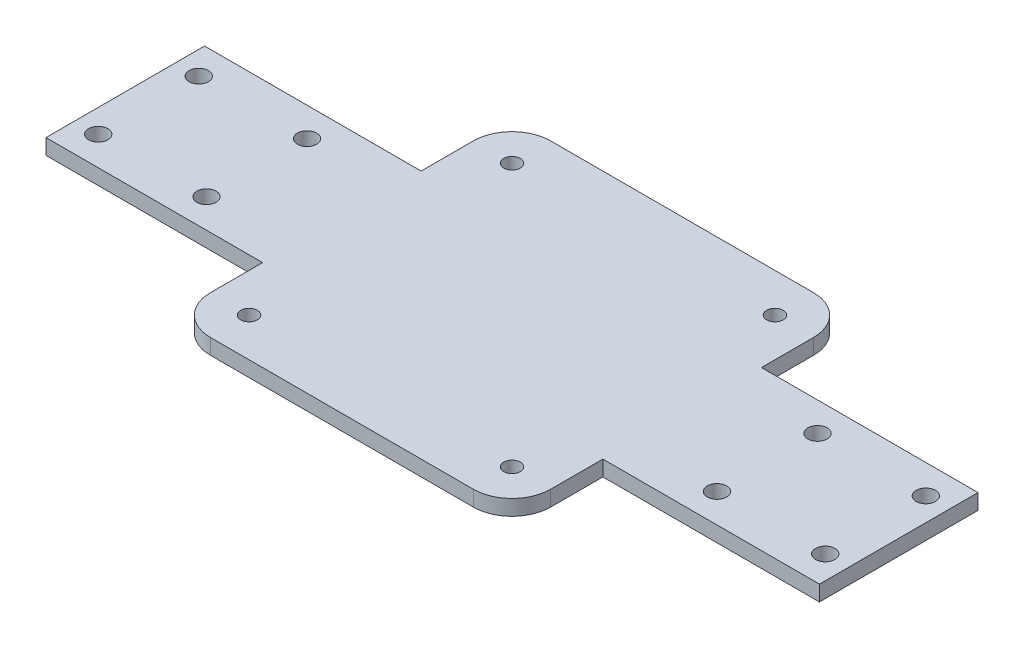
ISO-10303-21;
HEADER;
FILE_DESCRIPTION(('STEP AP214'),'2;1');
FILE_NAME('part.step','',(''),(''),'','','');
FILE_SCHEMA(('AUTOMOTIVE_DESIGN { 1 0 10303 214 1 1 1 1 }'));
ENDSEC;
DATA;
#1=APPLICATION_CONTEXT('core data for automotive mechanical design processes');
#2=APPLICATION_PROTOCOL_DEFINITION('international standard','automotive_design',2000,#1);
#3=PRODUCT_CONTEXT('',#1,'mechanical');
#4=PRODUCT('Part','Part','',(#3));
#5=PRODUCT_RELATED_PRODUCT_CATEGORY('part','',(#4));
#6=PRODUCT_DEFINITION_FORMATION('','',#4);
#7=PRODUCT_DEFINITION_CONTEXT('part definition',#1,'design');
#8=PRODUCT_DEFINITION('design','',#6,#7);
#9=PRODUCT_DEFINITION_SHAPE('','',#8);
#10=(LENGTH_UNIT() NAMED_UNIT(*) SI_UNIT(.MILLI.,.METRE.));
#11=(NAMED_UNIT(*) PLANE_ANGLE_UNIT() SI_UNIT($,.RADIAN.));
#12=(NAMED_UNIT(*) SI_UNIT($,.STERADIAN.) SOLID_ANGLE_UNIT());
#13=UNCERTAINTY_MEASURE_WITH_UNIT(LENGTH_MEASURE(1.E-05),#10,'distance_accuracy_value','');
#14=(GEOMETRIC_REPRESENTATION_CONTEXT(3) GLOBAL_UNCERTAINTY_ASSIGNED_CONTEXT((#13)) GLOBAL_UNIT_ASSIGNED_CONTEXT((#10,
#11,#12)) REPRESENTATION_CONTEXT('',''));
#15=CARTESIAN_POINT('',(0.,0.,0.));
#16=DIRECTION('',(0.,0.,1.));
#17=DIRECTION('',(1.,0.,0.));
#18=AXIS2_PLACEMENT_3D('',#15,#16,#17);
#19=CARTESIAN_POINT('',(-44.,4.,44.));
#20=DIRECTION('',(1.,0.,0.));
#21=DIRECTION('',(0.,0.,-1.));
#22=AXIS2_PLACEMENT_3D('',#19,#20,#21);
#23=PLANE('',#22);
#24=DIRECTION('',(0.,1.,0.));
#25=VECTOR('',#24,1.);
#26=CARTESIAN_POINT('',(-44.,4.,20.5));
#27=LINE('',#26,#25);
#28=CARTESIAN_POINT('',(-44.,0.,20.5));
#29=VERTEX_POINT('',#28);
#30=CARTESIAN_POINT('',(-44.,4.,20.5));
#31=VERTEX_POINT('',#30);
#32=EDGE_CURVE('E197',#29,#31,#27,.T.);
#33=ORIENTED_EDGE('',*,*,#32,.F.);
#34=DIRECTION('',(0.,0.,1.));
#35=VECTOR('',#34,1.);
#36=CARTESIAN_POINT('',(-44.,0.,44.));
#37=LINE('',#36,#35);
#38=CARTESIAN_POINT('',(-44.,0.,34.));
#39=VERTEX_POINT('',#38);
#40=EDGE_CURVE('E221',#29,#39,#37,.T.);
#41=ORIENTED_EDGE('',*,*,#40,.T.);
#42=DIRECTION('',(0.,-1.,0.));
#43=VECTOR('',#42,1.);
#44=CARTESIAN_POINT('',(-44.,4.,34.));
#45=LINE('',#44,#43);
#46=CARTESIAN_POINT('',(-44.,4.,34.));
#47=VERTEX_POINT('',#46);
#48=EDGE_CURVE('E267',#39,#47,#45,.F.);
#49=ORIENTED_EDGE('',*,*,#48,.T.);
#50=DIRECTION('',(0.,0.,1.));
#51=VECTOR('',#50,1.);
#52=CARTESIAN_POINT('',(-44.,4.,44.));
#53=LINE('',#52,#51);
#54=EDGE_CURVE('E227',#31,#47,#53,.T.);
#55=ORIENTED_EDGE('',*,*,#54,.F.);
#56=EDGE_LOOP('',(#33,#41,#49,#55));
#57=FACE_BOUND('',#56,.T.);
#58=ADVANCED_FACE('F39',(#57),#23,.F.);
#59=DIRECTION('',(0.,-1.,0.));
#60=VECTOR('',#59,1.);
#61=CARTESIAN_POINT('',(-44.,4.,-20.5));
#62=LINE('',#61,#60);
#63=CARTESIAN_POINT('',(-44.,4.,-20.5));
#64=VERTEX_POINT('',#63);
#65=CARTESIAN_POINT('',(-44.,0.,-20.5));
#66=VERTEX_POINT('',#65);
#67=EDGE_CURVE('E176',#64,#66,#62,.T.);
#68=ORIENTED_EDGE('',*,*,#67,.F.);
#69=CARTESIAN_POINT('',(-44.,4.,-34.));
#70=VERTEX_POINT('',#69);
#71=EDGE_CURVE('E224',#70,#64,#53,.T.);
#72=ORIENTED_EDGE('',*,*,#71,.F.);
#73=DIRECTION('',(0.,-1.,0.));
#74=VECTOR('',#73,1.);
#75=CARTESIAN_POINT('',(-44.,4.,-34.));
#76=LINE('',#75,#74);
#77=CARTESIAN_POINT('',(-44.,0.,-34.));
#78=VERTEX_POINT('',#77);
#79=EDGE_CURVE('E264',#70,#78,#76,.T.);
#80=ORIENTED_EDGE('',*,*,#79,.T.);
#81=EDGE_CURVE('E237',#78,#66,#37,.T.);
#82=ORIENTED_EDGE('',*,*,#81,.T.);
#83=EDGE_LOOP('',(#68,#72,#80,#82));
#84=FACE_BOUND('',#83,.T.);
#85=ADVANCED_FACE('F297',(#84),#23,.F.);
#86=CARTESIAN_POINT('',(44.,4.,44.));
#87=DIRECTION('',(-1.,0.,0.));
#88=DIRECTION('',(0.,0.,1.));
#89=AXIS2_PLACEMENT_3D('',#86,#87,#88);
#90=PLANE('',#89);
#91=DIRECTION('',(0.,-1.,0.));
#92=VECTOR('',#91,1.);
#93=CARTESIAN_POINT('',(44.,4.,20.5));
#94=LINE('',#93,#92);
#95=CARTESIAN_POINT('',(44.,4.,20.5));
#96=VERTEX_POINT('',#95);
#97=CARTESIAN_POINT('',(44.,0.,20.5));
#98=VERTEX_POINT('',#97);
#99=EDGE_CURVE('E195',#96,#98,#94,.T.);
#100=ORIENTED_EDGE('',*,*,#99,.F.);
#101=DIRECTION('',(0.,0.,-1.));
#102=VECTOR('',#101,1.);
#103=CARTESIAN_POINT('',(44.,4.,44.));
#104=LINE('',#103,#102);
#105=CARTESIAN_POINT('',(44.,4.,34.));
#106=VERTEX_POINT('',#105);
#107=EDGE_CURVE('E231',#106,#96,#104,.T.);
#108=ORIENTED_EDGE('',*,*,#107,.F.);
#109=DIRECTION('',(0.,-1.,0.));
#110=VECTOR('',#109,1.);
#111=CARTESIAN_POINT('',(44.,4.,34.));
#112=LINE('',#111,#110);
#113=CARTESIAN_POINT('',(44.,0.,34.));
#114=VERTEX_POINT('',#113);
#115=EDGE_CURVE('E281',#106,#114,#112,.T.);
#116=ORIENTED_EDGE('',*,*,#115,.T.);
#117=DIRECTION('',(0.,0.,-1.));
#118=VECTOR('',#117,1.);
#119=CARTESIAN_POINT('',(44.,0.,44.));
#120=LINE('',#119,#118);
#121=EDGE_CURVE('E244',#114,#98,#120,.T.);
#122=ORIENTED_EDGE('',*,*,#121,.T.);
#123=EDGE_LOOP('',(#100,#108,#116,#122));
#124=FACE_BOUND('',#123,.T.);
#125=ADVANCED_FACE('F342',(#124),#90,.F.);
#126=DIRECTION('',(0.,1.,0.));
#127=VECTOR('',#126,1.);
#128=CARTESIAN_POINT('',(44.,4.,-20.5));
#129=LINE('',#128,#127);
#130=CARTESIAN_POINT('',(44.,0.,-20.5));
#131=VERTEX_POINT('',#130);
#132=CARTESIAN_POINT('',(44.,4.,-20.5));
#133=VERTEX_POINT('',#132);
#134=EDGE_CURVE('E165',#131,#133,#129,.T.);
#135=ORIENTED_EDGE('',*,*,#134,.F.);
#136=CARTESIAN_POINT('',(44.,0.,-34.));
#137=VERTEX_POINT('',#136);
#138=EDGE_CURVE('E243',#131,#137,#120,.T.);
#139=ORIENTED_EDGE('',*,*,#138,.T.);
#140=DIRECTION('',(0.,-1.,0.));
#141=VECTOR('',#140,1.);
#142=CARTESIAN_POINT('',(44.,4.,-34.));
#143=LINE('',#142,#141);
#144=CARTESIAN_POINT('',(44.,4.,-34.));
#145=VERTEX_POINT('',#144);
#146=EDGE_CURVE('E278',#137,#145,#143,.F.);
#147=ORIENTED_EDGE('',*,*,#146,.T.);
#148=EDGE_CURVE('E230',#133,#145,#104,.T.);
#149=ORIENTED_EDGE('',*,*,#148,.F.);
#150=EDGE_LOOP('',(#135,#139,#147,#149));
#151=FACE_BOUND('',#150,.T.);
#152=ADVANCED_FACE('F322',(#151),#90,.F.);
#153=CARTESIAN_POINT('',(44.,4.,44.));
#154=DIRECTION('',(0.,0.,-1.));
#155=DIRECTION('',(-1.,0.,0.));
#156=AXIS2_PLACEMENT_3D('',#153,#154,#155);
#157=PLANE('',#156);
#158=DIRECTION('',(1.,0.,0.));
#159=VECTOR('',#158,1.);
#160=CARTESIAN_POINT('',(44.,4.,44.));
#161=LINE('',#160,#159);
#162=CARTESIAN_POINT('',(-34.,4.,44.));
#163=VERTEX_POINT('',#162);
#164=CARTESIAN_POINT('',(34.,4.,44.));
#165=VERTEX_POINT('',#164);
#166=EDGE_CURVE('E226',#163,#165,#161,.T.);
#167=ORIENTED_EDGE('',*,*,#166,.F.);
#168=DIRECTION('',(0.,-1.,0.));
#169=VECTOR('',#168,1.);
#170=CARTESIAN_POINT('',(-34.,4.,44.));
#171=LINE('',#170,#169);
#172=CARTESIAN_POINT('',(-34.,0.,44.));
#173=VERTEX_POINT('',#172);
#174=EDGE_CURVE('E251',#163,#173,#171,.T.);
#175=ORIENTED_EDGE('',*,*,#174,.T.);
#176=DIRECTION('',(1.,0.,0.));
#177=VECTOR('',#176,1.);
#178=CARTESIAN_POINT('',(44.,0.,44.));
#179=LINE('',#178,#177);
#180=CARTESIAN_POINT('',(34.,0.,44.));
#181=VERTEX_POINT('',#180);
#182=EDGE_CURVE('E240',#173,#181,#179,.T.);
#183=ORIENTED_EDGE('',*,*,#182,.T.);
#184=DIRECTION('',(0.,-1.,0.));
#185=VECTOR('',#184,1.);
#186=CARTESIAN_POINT('',(34.,4.,44.));
#187=LINE('',#186,#185);
#188=EDGE_CURVE('E236',#181,#165,#187,.F.);
#189=ORIENTED_EDGE('',*,*,#188,.T.);
#190=EDGE_LOOP('',(#167,#175,#183,#189));
#191=FACE_BOUND('',#190,.T.);
#192=ADVANCED_FACE('F345',(#191),#157,.F.);
#193=CARTESIAN_POINT('',(44.,4.,-44.));
#194=DIRECTION('',(0.,0.,1.));
#195=DIRECTION('',(1.,0.,0.));
#196=AXIS2_PLACEMENT_3D('',#193,#194,#195);
#197=PLANE('',#196);
#198=DIRECTION('',(-1.,0.,0.));
#199=VECTOR('',#198,1.);
#200=CARTESIAN_POINT('',(44.,4.,-44.));
#201=LINE('',#200,#199);
#202=CARTESIAN_POINT('',(34.,4.,-44.));
#203=VERTEX_POINT('',#202);
#204=CARTESIAN_POINT('',(-34.,4.,-44.));
#205=VERTEX_POINT('',#204);
#206=EDGE_CURVE('E233',#203,#205,#201,.T.);
#207=ORIENTED_EDGE('',*,*,#206,.F.);
#208=DIRECTION('',(0.,-1.,0.));
#209=VECTOR('',#208,1.);
#210=CARTESIAN_POINT('',(34.,4.,-44.));
#211=LINE('',#210,#209);
#212=CARTESIAN_POINT('',(34.,0.,-44.));
#213=VERTEX_POINT('',#212);
#214=EDGE_CURVE('E11',#203,#213,#211,.T.);
#215=ORIENTED_EDGE('',*,*,#214,.T.);
#216=DIRECTION('',(-1.,0.,0.));
#217=VECTOR('',#216,1.);
#218=CARTESIAN_POINT('',(44.,0.,-44.));
#219=LINE('',#218,#217);
#220=CARTESIAN_POINT('',(-34.,0.,-44.));
#221=VERTEX_POINT('',#220);
#222=EDGE_CURVE('E247',#213,#221,#219,.T.);
#223=ORIENTED_EDGE('',*,*,#222,.T.);
#224=DIRECTION('',(0.,-1.,0.));
#225=VECTOR('',#224,1.);
#226=CARTESIAN_POINT('',(-34.,4.,-44.));
#227=LINE('',#226,#225);
#228=EDGE_CURVE('E47',#221,#205,#227,.F.);
#229=ORIENTED_EDGE('',*,*,#228,.T.);
#230=EDGE_LOOP('',(#207,#215,#223,#229));
#231=FACE_BOUND('',#230,.T.);
#232=ADVANCED_FACE('F286',(#231),#197,.F.);
#233=CARTESIAN_POINT('',(0.,4.,0.));
#234=DIRECTION('',(0.,1.,0.));
#235=DIRECTION('',(0.,0.,1.));
#236=AXIS2_PLACEMENT_3D('',#233,#234,#235);
#237=PLANE('',#236);
#238=CARTESIAN_POINT('',(66.,4.,13.));
#239=DIRECTION('',(0.,1.,0.));
#240=DIRECTION('',(0.,0.,-1.));
#241=AXIS2_PLACEMENT_3D('',#238,#239,#240);
#242=CIRCLE('',#241,2.50000000000001);
#243=CARTESIAN_POINT('',(66.,4.,10.5));
#244=VERTEX_POINT('',#243);
#245=EDGE_CURVE('E741',#244,#244,#242,.T.);
#246=ORIENTED_EDGE('',*,*,#245,.F.);
#247=EDGE_LOOP('',(#246));
#248=FACE_BOUND('',#247,.T.);
#249=CARTESIAN_POINT('',(94.,4.,-13.));
#250=DIRECTION('',(0.,1.,0.));
#251=DIRECTION('',(0.,0.,-1.));
#252=AXIS2_PLACEMENT_3D('',#249,#250,#251);
#253=CIRCLE('',#252,2.50000000000001);
#254=CARTESIAN_POINT('',(94.,4.,-15.5));
#255=VERTEX_POINT('',#254);
#256=EDGE_CURVE('E745',#255,#255,#253,.T.);
#257=ORIENTED_EDGE('',*,*,#256,.F.);
#258=EDGE_LOOP('',(#257));
#259=FACE_BOUND('',#258,.T.);
#260=CARTESIAN_POINT('',(94.,4.,13.));
#261=DIRECTION('',(0.,1.,0.));
#262=DIRECTION('',(0.,0.,-1.));
#263=AXIS2_PLACEMENT_3D('',#260,#261,#262);
#264=CIRCLE('',#263,2.50000000000001);
#265=CARTESIAN_POINT('',(94.,4.,10.5));
#266=VERTEX_POINT('',#265);
#267=EDGE_CURVE('E756',#266,#266,#264,.T.);
#268=ORIENTED_EDGE('',*,*,#267,.F.);
#269=EDGE_LOOP('',(#268));
#270=FACE_BOUND('',#269,.T.);
#271=CARTESIAN_POINT('',(66.,4.,-13.));
#272=DIRECTION('',(0.,1.,0.));
#273=DIRECTION('',(0.,0.,-1.));
#274=AXIS2_PLACEMENT_3D('',#271,#272,#273);
#275=CIRCLE('',#274,2.50000000000001);
#276=CARTESIAN_POINT('',(66.,4.,-15.5));
#277=VERTEX_POINT('',#276);
#278=EDGE_CURVE('E757',#277,#277,#275,.T.);
#279=ORIENTED_EDGE('',*,*,#278,.F.);
#280=EDGE_LOOP('',(#279));
#281=FACE_BOUND('',#280,.T.);
#282=CARTESIAN_POINT('',(-66.,4.,13.));
#283=DIRECTION('',(0.,-1.,0.));
#284=DIRECTION('',(0.,0.,-1.));
#285=AXIS2_PLACEMENT_3D('',#282,#283,#284);
#286=CIRCLE('',#285,2.50000000000001);
#287=CARTESIAN_POINT('',(-66.,4.,10.5));
#288=VERTEX_POINT('',#287);
#289=EDGE_CURVE('E772',#288,#288,#286,.T.);
#290=ORIENTED_EDGE('',*,*,#289,.T.);
#291=EDGE_LOOP('',(#290));
#292=FACE_BOUND('',#291,.T.);
#293=CARTESIAN_POINT('',(-94.,4.,-13.));
#294=DIRECTION('',(0.,-1.,0.));
#295=DIRECTION('',(0.,0.,-1.));
#296=AXIS2_PLACEMENT_3D('',#293,#294,#295);
#297=CIRCLE('',#296,2.50000000000001);
#298=CARTESIAN_POINT('',(-94.,4.,-15.5));
#299=VERTEX_POINT('',#298);
#300=EDGE_CURVE('E766',#299,#299,#297,.T.);
#301=ORIENTED_EDGE('',*,*,#300,.T.);
#302=EDGE_LOOP('',(#301));
#303=FACE_BOUND('',#302,.T.);
#304=CARTESIAN_POINT('',(-94.,4.,13.));
#305=DIRECTION('',(0.,-1.,0.));
#306=DIRECTION('',(0.,0.,-1.));
#307=AXIS2_PLACEMENT_3D('',#304,#305,#306);
#308=CIRCLE('',#307,2.50000000000001);
#309=CARTESIAN_POINT('',(-94.,4.,10.5));
#310=VERTEX_POINT('',#309);
#311=EDGE_CURVE('E760',#310,#310,#308,.T.);
#312=ORIENTED_EDGE('',*,*,#311,.T.);
#313=EDGE_LOOP('',(#312));
#314=FACE_BOUND('',#313,.T.);
#315=CARTESIAN_POINT('',(-66.,4.,-13.));
#316=DIRECTION('',(0.,-1.,0.));
#317=DIRECTION('',(0.,0.,-1.));
#318=AXIS2_PLACEMENT_3D('',#315,#316,#317);
#319=CIRCLE('',#318,2.50000000000001);
#320=CARTESIAN_POINT('',(-66.,4.,-15.5));
#321=VERTEX_POINT('',#320);
#322=EDGE_CURVE('E192',#321,#321,#319,.T.);
#323=ORIENTED_EDGE('',*,*,#322,.T.);
#324=EDGE_LOOP('',(#323));
#325=FACE_BOUND('',#324,.T.);
#326=ORIENTED_EDGE('',*,*,#71,.T.);
#327=DIRECTION('',(-1.,0.,0.));
#328=VECTOR('',#327,1.);
#329=CARTESIAN_POINT('',(100.,4.,-20.5));
#330=LINE('',#329,#328);
#331=CARTESIAN_POINT('',(-100.,4.,-20.5));
#332=VERTEX_POINT('',#331);
#333=EDGE_CURVE('E168',#64,#332,#330,.T.);
#334=ORIENTED_EDGE('',*,*,#333,.T.);
#335=DIRECTION('',(0.,0.,1.));
#336=VECTOR('',#335,1.);
#337=CARTESIAN_POINT('',(-100.,4.,20.5));
#338=LINE('',#337,#336);
#339=CARTESIAN_POINT('',(-100.,4.,20.5));
#340=VERTEX_POINT('',#339);
#341=EDGE_CURVE('E167',#332,#340,#338,.T.);
#342=ORIENTED_EDGE('',*,*,#341,.T.);
#343=DIRECTION('',(1.,0.,0.));
#344=VECTOR('',#343,1.);
#345=CARTESIAN_POINT('',(100.,4.,20.5));
#346=LINE('',#345,#344);
#347=EDGE_CURVE('E61',#340,#31,#346,.T.);
#348=ORIENTED_EDGE('',*,*,#347,.T.);
#349=ORIENTED_EDGE('',*,*,#54,.T.);
#350=CARTESIAN_POINT('',(-34.,4.,34.));
#351=DIRECTION('',(0.,1.,0.));
#352=DIRECTION('',(0.,0.,1.));
#353=AXIS2_PLACEMENT_3D('',#350,#351,#352);
#354=CIRCLE('',#353,10.);
#355=EDGE_CURVE('E276',#47,#163,#354,.T.);
#356=ORIENTED_EDGE('',*,*,#355,.T.);
#357=ORIENTED_EDGE('',*,*,#166,.T.);
#358=CARTESIAN_POINT('',(34.,4.,34.));
#359=DIRECTION('',(0.,1.,0.));
#360=DIRECTION('',(0.,0.,1.));
#361=AXIS2_PLACEMENT_3D('',#358,#359,#360);
#362=CIRCLE('',#361,10.);
#363=EDGE_CURVE('E274',#165,#106,#362,.T.);
#364=ORIENTED_EDGE('',*,*,#363,.T.);
#365=ORIENTED_EDGE('',*,*,#107,.T.);
#366=CARTESIAN_POINT('',(100.,4.,20.5));
#367=VERTEX_POINT('',#366);
#368=EDGE_CURVE('E174',#96,#367,#346,.T.);
#369=ORIENTED_EDGE('',*,*,#368,.T.);
#370=DIRECTION('',(0.,0.,-1.));
#371=VECTOR('',#370,1.);
#372=CARTESIAN_POINT('',(100.,4.,20.5));
#373=LINE('',#372,#371);
#374=CARTESIAN_POINT('',(100.,4.,-20.5));
#375=VERTEX_POINT('',#374);
#376=EDGE_CURVE('E155',#367,#375,#373,.T.);
#377=ORIENTED_EDGE('',*,*,#376,.T.);
#378=EDGE_CURVE('E54',#375,#133,#330,.T.);
#379=ORIENTED_EDGE('',*,*,#378,.T.);
#380=ORIENTED_EDGE('',*,*,#148,.T.);
#381=CARTESIAN_POINT('',(34.,4.,-34.));
#382=DIRECTION('',(0.,1.,0.));
#383=DIRECTION('',(0.,0.,1.));
#384=AXIS2_PLACEMENT_3D('',#381,#382,#383);
#385=CIRCLE('',#384,10.);
#386=EDGE_CURVE('E272',#145,#203,#385,.T.);
#387=ORIENTED_EDGE('',*,*,#386,.T.);
#388=ORIENTED_EDGE('',*,*,#206,.T.);
#389=CARTESIAN_POINT('',(-34.,4.,-34.));
#390=DIRECTION('',(0.,1.,0.));
#391=DIRECTION('',(0.,0.,1.));
#392=AXIS2_PLACEMENT_3D('',#389,#390,#391);
#393=CIRCLE('',#392,10.);
#394=EDGE_CURVE('E270',#205,#70,#393,.T.);
#395=ORIENTED_EDGE('',*,*,#394,.T.);
#396=EDGE_LOOP('',(#326,#334,#342,#348,#349,#356,#357,#364,#365,#369,#377,#379,#380,#387,#388,#395));
#397=FACE_BOUND('',#396,.T.);
#398=CARTESIAN_POINT('',(34.,4.,-34.));
#399=DIRECTION('',(0.,1.,0.));
#400=DIRECTION('',(0.,0.,1.));
#401=AXIS2_PLACEMENT_3D('',#398,#399,#400);
#402=CIRCLE('',#401,2.15);
#403=CARTESIAN_POINT('',(34.,4.,-31.85));
#404=VERTEX_POINT('',#403);
#405=EDGE_CURVE('E209',#404,#404,#402,.T.);
#406=ORIENTED_EDGE('',*,*,#405,.F.);
#407=EDGE_LOOP('',(#406));
#408=FACE_BOUND('',#407,.T.);
#409=CARTESIAN_POINT('',(-34.,4.,-34.));
#410=DIRECTION('',(0.,1.,0.));
#411=DIRECTION('',(0.,0.,1.));
#412=AXIS2_PLACEMENT_3D('',#409,#410,#411);
#413=CIRCLE('',#412,2.15);
#414=CARTESIAN_POINT('',(-34.,4.,-31.85));
#415=VERTEX_POINT('',#414);
#416=EDGE_CURVE('E206',#415,#415,#413,.T.);
#417=ORIENTED_EDGE('',*,*,#416,.F.);
#418=EDGE_LOOP('',(#417));
#419=FACE_BOUND('',#418,.T.);
#420=CARTESIAN_POINT('',(34.,4.,34.));
#421=DIRECTION('',(0.,1.,0.));
#422=DIRECTION('',(0.,0.,1.));
#423=AXIS2_PLACEMENT_3D('',#420,#421,#422);
#424=CIRCLE('',#423,2.15);
#425=CARTESIAN_POINT('',(34.,4.,36.15));
#426=VERTEX_POINT('',#425);
#427=EDGE_CURVE('E213',#426,#426,#424,.T.);
#428=ORIENTED_EDGE('',*,*,#427,.F.);
#429=EDGE_LOOP('',(#428));
#430=FACE_BOUND('',#429,.T.);
#431=CARTESIAN_POINT('',(-34.,4.,34.));
#432=DIRECTION('',(0.,1.,0.));
#433=DIRECTION('',(0.,0.,1.));
#434=AXIS2_PLACEMENT_3D('',#431,#432,#433);
#435=CIRCLE('',#434,2.15);
#436=CARTESIAN_POINT('',(-34.,4.,36.15));
#437=VERTEX_POINT('',#436);
#438=EDGE_CURVE('E200',#437,#437,#435,.T.);
#439=ORIENTED_EDGE('',*,*,#438,.F.);
#440=EDGE_LOOP('',(#439));
#441=FACE_BOUND('',#440,.T.);
#442=ADVANCED_FACE('F171',(#248,#259,#270,#281,#292,#303,#314,#325,#397,#408,#419,#430,#441),
#237,.T.);
#443=CARTESIAN_POINT('',(0.,0.,0.));
#444=DIRECTION('',(0.,1.,0.));
#445=DIRECTION('',(0.,0.,1.));
#446=AXIS2_PLACEMENT_3D('',#443,#444,#445);
#447=PLANE('',#446);
#448=CARTESIAN_POINT('',(66.,0.,13.));
#449=DIRECTION('',(0.,1.,0.));
#450=DIRECTION('',(0.,0.,-1.));
#451=AXIS2_PLACEMENT_3D('',#448,#449,#450);
#452=CIRCLE('',#451,2.50000000000001);
#453=CARTESIAN_POINT('',(66.,0.,10.5));
#454=VERTEX_POINT('',#453);
#455=EDGE_CURVE('E744',#454,#454,#452,.T.);
#456=ORIENTED_EDGE('',*,*,#455,.T.);
#457=EDGE_LOOP('',(#456));
#458=FACE_BOUND('',#457,.T.);
#459=CARTESIAN_POINT('',(94.,0.,-13.));
#460=DIRECTION('',(0.,1.,0.));
#461=DIRECTION('',(0.,0.,-1.));
#462=AXIS2_PLACEMENT_3D('',#459,#460,#461);
#463=CIRCLE('',#462,2.50000000000001);
#464=CARTESIAN_POINT('',(94.,0.,-15.5));
#465=VERTEX_POINT('',#464);
#466=EDGE_CURVE('E750',#465,#465,#463,.T.);
#467=ORIENTED_EDGE('',*,*,#466,.T.);
#468=EDGE_LOOP('',(#467));
#469=FACE_BOUND('',#468,.T.);
#470=CARTESIAN_POINT('',(94.,0.,13.));
#471=DIRECTION('',(0.,1.,0.));
#472=DIRECTION('',(0.,0.,-1.));
#473=AXIS2_PLACEMENT_3D('',#470,#471,#472);
#474=CIRCLE('',#473,2.50000000000001);
#475=CARTESIAN_POINT('',(94.,0.,10.5));
#476=VERTEX_POINT('',#475);
#477=EDGE_CURVE('E809',#476,#476,#474,.T.);
#478=ORIENTED_EDGE('',*,*,#477,.T.);
#479=EDGE_LOOP('',(#478));
#480=FACE_BOUND('',#479,.T.);
#481=CARTESIAN_POINT('',(66.,0.,-13.));
#482=DIRECTION('',(0.,1.,0.));
#483=DIRECTION('',(0.,0.,-1.));
#484=AXIS2_PLACEMENT_3D('',#481,#482,#483);
#485=CIRCLE('',#484,2.50000000000001);
#486=CARTESIAN_POINT('',(66.,0.,-15.5));
#487=VERTEX_POINT('',#486);
#488=EDGE_CURVE('E747',#487,#487,#485,.T.);
#489=ORIENTED_EDGE('',*,*,#488,.T.);
#490=EDGE_LOOP('',(#489));
#491=FACE_BOUND('',#490,.T.);
#492=CARTESIAN_POINT('',(-66.,0.,13.));
#493=DIRECTION('',(0.,-1.,0.));
#494=DIRECTION('',(0.,0.,-1.));
#495=AXIS2_PLACEMENT_3D('',#492,#493,#494);
#496=CIRCLE('',#495,2.50000000000001);
#497=CARTESIAN_POINT('',(-66.,0.,10.5));
#498=VERTEX_POINT('',#497);
#499=EDGE_CURVE('E769',#498,#498,#496,.T.);
#500=ORIENTED_EDGE('',*,*,#499,.F.);
#501=EDGE_LOOP('',(#500));
#502=FACE_BOUND('',#501,.T.);
#503=CARTESIAN_POINT('',(-94.,0.,-13.));
#504=DIRECTION('',(0.,-1.,0.));
#505=DIRECTION('',(0.,0.,-1.));
#506=AXIS2_PLACEMENT_3D('',#503,#504,#505);
#507=CIRCLE('',#506,2.50000000000001);
#508=CARTESIAN_POINT('',(-94.,0.,-15.5));
#509=VERTEX_POINT('',#508);
#510=EDGE_CURVE('E775',#509,#509,#507,.T.);
#511=ORIENTED_EDGE('',*,*,#510,.F.);
#512=EDGE_LOOP('',(#511));
#513=FACE_BOUND('',#512,.T.);
#514=CARTESIAN_POINT('',(-94.,0.,13.));
#515=DIRECTION('',(0.,-1.,0.));
#516=DIRECTION('',(0.,0.,-1.));
#517=AXIS2_PLACEMENT_3D('',#514,#515,#516);
#518=CIRCLE('',#517,2.50000000000001);
#519=CARTESIAN_POINT('',(-94.,0.,10.5));
#520=VERTEX_POINT('',#519);
#521=EDGE_CURVE('E763',#520,#520,#518,.T.);
#522=ORIENTED_EDGE('',*,*,#521,.F.);
#523=EDGE_LOOP('',(#522));
#524=FACE_BOUND('',#523,.T.);
#525=CARTESIAN_POINT('',(-66.,0.,-13.));
#526=DIRECTION('',(0.,-1.,0.));
#527=DIRECTION('',(0.,0.,-1.));
#528=AXIS2_PLACEMENT_3D('',#525,#526,#527);
#529=CIRCLE('',#528,2.50000000000001);
#530=CARTESIAN_POINT('',(-66.,0.,-15.5));
#531=VERTEX_POINT('',#530);
#532=EDGE_CURVE('E312',#531,#531,#529,.T.);
#533=ORIENTED_EDGE('',*,*,#532,.F.);
#534=EDGE_LOOP('',(#533));
#535=FACE_BOUND('',#534,.T.);
#536=ORIENTED_EDGE('',*,*,#138,.F.);
#537=DIRECTION('',(-1.,0.,0.));
#538=VECTOR('',#537,1.);
#539=CARTESIAN_POINT('',(100.,0.,-20.5));
#540=LINE('',#539,#538);
#541=CARTESIAN_POINT('',(100.,0.,-20.5));
#542=VERTEX_POINT('',#541);
#543=EDGE_CURVE('E308',#542,#131,#540,.T.);
#544=ORIENTED_EDGE('',*,*,#543,.F.);
#545=DIRECTION('',(0.,0.,-1.));
#546=VECTOR('',#545,1.);
#547=CARTESIAN_POINT('',(100.,0.,20.5));
#548=LINE('',#547,#546);
#549=CARTESIAN_POINT('',(100.,0.,20.5));
#550=VERTEX_POINT('',#549);
#551=EDGE_CURVE('E158',#550,#542,#548,.T.);
#552=ORIENTED_EDGE('',*,*,#551,.F.);
#553=DIRECTION('',(1.,0.,0.));
#554=VECTOR('',#553,1.);
#555=CARTESIAN_POINT('',(100.,0.,20.5));
#556=LINE('',#555,#554);
#557=EDGE_CURVE('E186',#98,#550,#556,.T.);
#558=ORIENTED_EDGE('',*,*,#557,.F.);
#559=ORIENTED_EDGE('',*,*,#121,.F.);
#560=CARTESIAN_POINT('',(34.,0.,34.));
#561=DIRECTION('',(0.,1.,0.));
#562=DIRECTION('',(0.,0.,1.));
#563=AXIS2_PLACEMENT_3D('',#560,#561,#562);
#564=CIRCLE('',#563,10.);
#565=EDGE_CURVE('E259',#114,#181,#564,.F.);
#566=ORIENTED_EDGE('',*,*,#565,.T.);
#567=ORIENTED_EDGE('',*,*,#182,.F.);
#568=CARTESIAN_POINT('',(-34.,0.,34.));
#569=DIRECTION('',(0.,1.,0.));
#570=DIRECTION('',(0.,0.,1.));
#571=AXIS2_PLACEMENT_3D('',#568,#569,#570);
#572=CIRCLE('',#571,10.);
#573=EDGE_CURVE('E261',#173,#39,#572,.F.);
#574=ORIENTED_EDGE('',*,*,#573,.T.);
#575=ORIENTED_EDGE('',*,*,#40,.F.);
#576=CARTESIAN_POINT('',(-100.,0.,20.5));
#577=VERTEX_POINT('',#576);
#578=EDGE_CURVE('E188',#577,#29,#556,.T.);
#579=ORIENTED_EDGE('',*,*,#578,.F.);
#580=DIRECTION('',(0.,0.,1.));
#581=VECTOR('',#580,1.);
#582=CARTESIAN_POINT('',(-100.,0.,20.5));
#583=LINE('',#582,#581);
#584=CARTESIAN_POINT('',(-100.,0.,-20.5));
#585=VERTEX_POINT('',#584);
#586=EDGE_CURVE('E180',#585,#577,#583,.T.);
#587=ORIENTED_EDGE('',*,*,#586,.F.);
#588=EDGE_CURVE('E161',#66,#585,#540,.T.);
#589=ORIENTED_EDGE('',*,*,#588,.F.);
#590=ORIENTED_EDGE('',*,*,#81,.F.);
#591=CARTESIAN_POINT('',(-34.,0.,-34.));
#592=DIRECTION('',(0.,1.,0.));
#593=DIRECTION('',(0.,0.,1.));
#594=AXIS2_PLACEMENT_3D('',#591,#592,#593);
#595=CIRCLE('',#594,10.);
#596=EDGE_CURVE('E254',#78,#221,#595,.F.);
#597=ORIENTED_EDGE('',*,*,#596,.T.);
#598=ORIENTED_EDGE('',*,*,#222,.F.);
#599=CARTESIAN_POINT('',(34.,0.,-34.));
#600=DIRECTION('',(0.,1.,0.));
#601=DIRECTION('',(0.,0.,1.));
#602=AXIS2_PLACEMENT_3D('',#599,#600,#601);
#603=CIRCLE('',#602,10.);
#604=EDGE_CURVE('E256',#213,#137,#603,.F.);
#605=ORIENTED_EDGE('',*,*,#604,.T.);
#606=EDGE_LOOP('',(#536,#544,#552,#558,#559,#566,#567,#574,#575,#579,#587,#589,#590,#597,#598,#605));
#607=FACE_BOUND('',#606,.T.);
#608=CARTESIAN_POINT('',(34.,0.,-34.));
#609=DIRECTION('',(0.,1.,0.));
#610=DIRECTION('',(0.,0.,1.));
#611=AXIS2_PLACEMENT_3D('',#608,#609,#610);
#612=CIRCLE('',#611,2.15);
#613=CARTESIAN_POINT('',(34.,0.,-31.85));
#614=VERTEX_POINT('',#613);
#615=EDGE_CURVE('E218',#614,#614,#612,.T.);
#616=ORIENTED_EDGE('',*,*,#615,.T.);
#617=EDGE_LOOP('',(#616));
#618=FACE_BOUND('',#617,.T.);
#619=CARTESIAN_POINT('',(-34.,0.,-34.));
#620=DIRECTION('',(0.,1.,0.));
#621=DIRECTION('',(0.,0.,1.));
#622=AXIS2_PLACEMENT_3D('',#619,#620,#621);
#623=CIRCLE('',#622,2.15);
#624=CARTESIAN_POINT('',(-34.,0.,-31.85));
#625=VERTEX_POINT('',#624);
#626=EDGE_CURVE('E210',#625,#625,#623,.T.);
#627=ORIENTED_EDGE('',*,*,#626,.T.);
#628=EDGE_LOOP('',(#627));
#629=FACE_BOUND('',#628,.T.);
#630=CARTESIAN_POINT('',(-34.,0.,34.));
#631=DIRECTION('',(0.,1.,0.));
#632=DIRECTION('',(0.,0.,1.));
#633=AXIS2_PLACEMENT_3D('',#630,#631,#632);
#634=CIRCLE('',#633,2.15);
#635=CARTESIAN_POINT('',(-34.,0.,36.15));
#636=VERTEX_POINT('',#635);
#637=EDGE_CURVE('E199',#636,#636,#634,.T.);
#638=ORIENTED_EDGE('',*,*,#637,.T.);
#639=EDGE_LOOP('',(#638));
#640=FACE_BOUND('',#639,.T.);
#641=CARTESIAN_POINT('',(34.,0.,34.));
#642=DIRECTION('',(0.,1.,0.));
#643=DIRECTION('',(0.,0.,1.));
#644=AXIS2_PLACEMENT_3D('',#641,#642,#643);
#645=CIRCLE('',#644,2.15);
#646=CARTESIAN_POINT('',(34.,0.,36.15));
#647=VERTEX_POINT('',#646);
#648=EDGE_CURVE('E203',#647,#647,#645,.T.);
#649=ORIENTED_EDGE('',*,*,#648,.T.);
#650=EDGE_LOOP('',(#649));
#651=FACE_BOUND('',#650,.T.);
#652=ADVANCED_FACE('F301',(#458,#469,#480,#491,#502,#513,#524,#535,#607,#618,#629,#640,#651),
#447,.F.);
#653=CARTESIAN_POINT('',(-34.,4.,34.));
#654=DIRECTION('',(0.,-1.,0.));
#655=DIRECTION('',(0.,0.,-1.));
#656=AXIS2_PLACEMENT_3D('',#653,#654,#655);
#657=CYLINDRICAL_SURFACE('',#656,10.);
#658=ORIENTED_EDGE('',*,*,#355,.F.);
#659=ORIENTED_EDGE('',*,*,#48,.F.);
#660=ORIENTED_EDGE('',*,*,#573,.F.);
#661=ORIENTED_EDGE('',*,*,#174,.F.);
#662=EDGE_LOOP('',(#658,#659,#660,#661));
#663=FACE_BOUND('',#662,.T.);
#664=ADVANCED_FACE('F333',(#663),#657,.T.);
#665=CARTESIAN_POINT('',(34.,4.,34.));
#666=DIRECTION('',(0.,-1.,0.));
#667=DIRECTION('',(0.,0.,-1.));
#668=AXIS2_PLACEMENT_3D('',#665,#666,#667);
#669=CYLINDRICAL_SURFACE('',#668,10.);
#670=ORIENTED_EDGE('',*,*,#363,.F.);
#671=ORIENTED_EDGE('',*,*,#188,.F.);
#672=ORIENTED_EDGE('',*,*,#565,.F.);
#673=ORIENTED_EDGE('',*,*,#115,.F.);
#674=EDGE_LOOP('',(#670,#671,#672,#673));
#675=FACE_BOUND('',#674,.T.);
#676=ADVANCED_FACE('F327',(#675),#669,.T.);
#677=CARTESIAN_POINT('',(34.,4.,-34.));
#678=DIRECTION('',(0.,-1.,0.));
#679=DIRECTION('',(0.,0.,-1.));
#680=AXIS2_PLACEMENT_3D('',#677,#678,#679);
#681=CYLINDRICAL_SURFACE('',#680,10.);
#682=ORIENTED_EDGE('',*,*,#386,.F.);
#683=ORIENTED_EDGE('',*,*,#146,.F.);
#684=ORIENTED_EDGE('',*,*,#604,.F.);
#685=ORIENTED_EDGE('',*,*,#214,.F.);
#686=EDGE_LOOP('',(#682,#683,#684,#685));
#687=FACE_BOUND('',#686,.T.);
#688=ADVANCED_FACE('F325',(#687),#681,.T.);
#689=CARTESIAN_POINT('',(-34.,4.,-34.));
#690=DIRECTION('',(0.,-1.,0.));
#691=DIRECTION('',(0.,0.,-1.));
#692=AXIS2_PLACEMENT_3D('',#689,#690,#691);
#693=CYLINDRICAL_SURFACE('',#692,10.);
#694=ORIENTED_EDGE('',*,*,#394,.F.);
#695=ORIENTED_EDGE('',*,*,#228,.F.);
#696=ORIENTED_EDGE('',*,*,#596,.F.);
#697=ORIENTED_EDGE('',*,*,#79,.F.);
#698=EDGE_LOOP('',(#694,#695,#696,#697));
#699=FACE_BOUND('',#698,.T.);
#700=ADVANCED_FACE('F41',(#699),#693,.T.);
#701=CARTESIAN_POINT('',(34.,0.,-34.));
#702=DIRECTION('',(0.,1.,0.));
#703=DIRECTION('',(0.,0.,1.));
#704=AXIS2_PLACEMENT_3D('',#701,#702,#703);
#705=CYLINDRICAL_SURFACE('',#704,2.15);
#706=ORIENTED_EDGE('',*,*,#615,.F.);
#707=EDGE_LOOP('',(#706));
#708=FACE_BOUND('',#707,.T.);
#709=ORIENTED_EDGE('',*,*,#405,.T.);
#710=EDGE_LOOP('',(#709));
#711=FACE_BOUND('',#710,.T.);
#712=ADVANCED_FACE('F332',(#708,#711),#705,.F.);
#713=CARTESIAN_POINT('',(-34.,0.,34.));
#714=DIRECTION('',(0.,1.,0.));
#715=DIRECTION('',(0.,0.,1.));
#716=AXIS2_PLACEMENT_3D('',#713,#714,#715);
#717=CYLINDRICAL_SURFACE('',#716,2.15);
#718=ORIENTED_EDGE('',*,*,#637,.F.);
#719=EDGE_LOOP('',(#718));
#720=FACE_BOUND('',#719,.T.);
#721=ORIENTED_EDGE('',*,*,#438,.T.);
#722=EDGE_LOOP('',(#721));
#723=FACE_BOUND('',#722,.T.);
#724=ADVANCED_FACE('F397',(#720,#723),#717,.F.);
#725=CARTESIAN_POINT('',(34.,0.,34.));
#726=DIRECTION('',(0.,1.,0.));
#727=DIRECTION('',(0.,0.,1.));
#728=AXIS2_PLACEMENT_3D('',#725,#726,#727);
#729=CYLINDRICAL_SURFACE('',#728,2.15);
#730=ORIENTED_EDGE('',*,*,#648,.F.);
#731=EDGE_LOOP('',(#730));
#732=FACE_BOUND('',#731,.T.);
#733=ORIENTED_EDGE('',*,*,#427,.T.);
#734=EDGE_LOOP('',(#733));
#735=FACE_BOUND('',#734,.T.);
#736=ADVANCED_FACE('F393',(#732,#735),#729,.F.);
#737=CARTESIAN_POINT('',(-34.,0.,-34.));
#738=DIRECTION('',(0.,1.,0.));
#739=DIRECTION('',(0.,0.,1.));
#740=AXIS2_PLACEMENT_3D('',#737,#738,#739);
#741=CYLINDRICAL_SURFACE('',#740,2.15);
#742=ORIENTED_EDGE('',*,*,#626,.F.);
#743=EDGE_LOOP('',(#742));
#744=FACE_BOUND('',#743,.T.);
#745=ORIENTED_EDGE('',*,*,#416,.T.);
#746=EDGE_LOOP('',(#745));
#747=FACE_BOUND('',#746,.T.);
#748=ADVANCED_FACE('F389',(#744,#747),#741,.F.);
#749=CARTESIAN_POINT('',(100.,208.159251566026,20.5));
#750=DIRECTION('',(-1.,0.,0.));
#751=DIRECTION('',(0.,0.,1.));
#752=AXIS2_PLACEMENT_3D('',#749,#750,#751);
#753=PLANE('',#752);
#754=ORIENTED_EDGE('',*,*,#376,.F.);
#755=DIRECTION('',(0.,-1.,0.));
#756=VECTOR('',#755,1.);
#757=CARTESIAN_POINT('',(100.,208.159251566026,20.5));
#758=LINE('',#757,#756);
#759=EDGE_CURVE('E187',#367,#550,#758,.T.);
#760=ORIENTED_EDGE('',*,*,#759,.T.);
#761=ORIENTED_EDGE('',*,*,#551,.T.);
#762=DIRECTION('',(0.,-1.,0.));
#763=VECTOR('',#762,1.);
#764=CARTESIAN_POINT('',(100.,208.159251566026,-20.5));
#765=LINE('',#764,#763);
#766=EDGE_CURVE('E152',#375,#542,#765,.T.);
#767=ORIENTED_EDGE('',*,*,#766,.F.);
#768=EDGE_LOOP('',(#754,#760,#761,#767));
#769=FACE_BOUND('',#768,.T.);
#770=ADVANCED_FACE('F153',(#769),#753,.F.);
#771=CARTESIAN_POINT('',(100.,208.159251566026,-20.5));
#772=DIRECTION('',(0.,0.,1.));
#773=DIRECTION('',(1.,0.,0.));
#774=AXIS2_PLACEMENT_3D('',#771,#772,#773);
#775=PLANE('',#774);
#776=ORIENTED_EDGE('',*,*,#543,.T.);
#777=ORIENTED_EDGE('',*,*,#134,.T.);
#778=ORIENTED_EDGE('',*,*,#378,.F.);
#779=ORIENTED_EDGE('',*,*,#766,.T.);
#780=EDGE_LOOP('',(#776,#777,#778,#779));
#781=FACE_BOUND('',#780,.T.);
#782=ADVANCED_FACE('F163',(#781),#775,.F.);
#783=CARTESIAN_POINT('',(100.,208.159251566026,20.5));
#784=DIRECTION('',(0.,0.,-1.));
#785=DIRECTION('',(-1.,0.,0.));
#786=AXIS2_PLACEMENT_3D('',#783,#784,#785);
#787=PLANE('',#786);
#788=ORIENTED_EDGE('',*,*,#368,.F.);
#789=ORIENTED_EDGE('',*,*,#99,.T.);
#790=ORIENTED_EDGE('',*,*,#557,.T.);
#791=ORIENTED_EDGE('',*,*,#759,.F.);
#792=EDGE_LOOP('',(#788,#789,#790,#791));
#793=FACE_BOUND('',#792,.T.);
#794=ADVANCED_FACE('F318',(#793),#787,.F.);
#795=ORIENTED_EDGE('',*,*,#578,.T.);
#796=ORIENTED_EDGE('',*,*,#32,.T.);
#797=ORIENTED_EDGE('',*,*,#347,.F.);
#798=DIRECTION('',(0.,-1.,0.));
#799=VECTOR('',#798,1.);
#800=CARTESIAN_POINT('',(-100.,208.159251566026,20.5));
#801=LINE('',#800,#799);
#802=EDGE_CURVE('E184',#340,#577,#801,.T.);
#803=ORIENTED_EDGE('',*,*,#802,.T.);
#804=EDGE_LOOP('',(#795,#796,#797,#803));
#805=FACE_BOUND('',#804,.T.);
#806=ADVANCED_FACE('F367',(#805),#787,.F.);
#807=ORIENTED_EDGE('',*,*,#333,.F.);
#808=ORIENTED_EDGE('',*,*,#67,.T.);
#809=ORIENTED_EDGE('',*,*,#588,.T.);
#810=DIRECTION('',(0.,-1.,0.));
#811=VECTOR('',#810,1.);
#812=CARTESIAN_POINT('',(-100.,208.159251566026,-20.5));
#813=LINE('',#812,#811);
#814=EDGE_CURVE('E190',#332,#585,#813,.T.);
#815=ORIENTED_EDGE('',*,*,#814,.F.);
#816=EDGE_LOOP('',(#807,#808,#809,#815));
#817=FACE_BOUND('',#816,.T.);
#818=ADVANCED_FACE('F372',(#817),#775,.F.);
#819=CARTESIAN_POINT('',(-100.,208.159251566026,20.5));
#820=DIRECTION('',(1.,0.,0.));
#821=DIRECTION('',(0.,0.,-1.));
#822=AXIS2_PLACEMENT_3D('',#819,#820,#821);
#823=PLANE('',#822);
#824=ORIENTED_EDGE('',*,*,#341,.F.);
#825=ORIENTED_EDGE('',*,*,#814,.T.);
#826=ORIENTED_EDGE('',*,*,#586,.T.);
#827=ORIENTED_EDGE('',*,*,#802,.F.);
#828=EDGE_LOOP('',(#824,#825,#826,#827));
#829=FACE_BOUND('',#828,.T.);
#830=ADVANCED_FACE('F371',(#829),#823,.F.);
#831=CARTESIAN_POINT('',(-66.,4.,-13.));
#832=DIRECTION('',(0.,-1.,0.));
#833=DIRECTION('',(0.,0.,-1.));
#834=AXIS2_PLACEMENT_3D('',#831,#832,#833);
#835=CYLINDRICAL_SURFACE('',#834,2.50000000000001);
#836=ORIENTED_EDGE('',*,*,#322,.F.);
#837=EDGE_LOOP('',(#836));
#838=FACE_BOUND('',#837,.T.);
#839=ORIENTED_EDGE('',*,*,#532,.T.);
#840=EDGE_LOOP('',(#839));
#841=FACE_BOUND('',#840,.T.);
#842=ADVANCED_FACE('F379',(#838,#841),#835,.F.);
#843=CARTESIAN_POINT('',(-94.,4.,13.));
#844=DIRECTION('',(0.,-1.,0.));
#845=DIRECTION('',(0.,0.,-1.));
#846=AXIS2_PLACEMENT_3D('',#843,#844,#845);
#847=CYLINDRICAL_SURFACE('',#846,2.50000000000001);
#848=ORIENTED_EDGE('',*,*,#311,.F.);
#849=EDGE_LOOP('',(#848));
#850=FACE_BOUND('',#849,.T.);
#851=ORIENTED_EDGE('',*,*,#521,.T.);
#852=EDGE_LOOP('',(#851));
#853=FACE_BOUND('',#852,.T.);
#854=ADVANCED_FACE('F518',(#850,#853),#847,.F.);
#855=CARTESIAN_POINT('',(-94.,4.,-13.));
#856=DIRECTION('',(0.,-1.,0.));
#857=DIRECTION('',(0.,0.,-1.));
#858=AXIS2_PLACEMENT_3D('',#855,#856,#857);
#859=CYLINDRICAL_SURFACE('',#858,2.50000000000001);
#860=ORIENTED_EDGE('',*,*,#300,.F.);
#861=EDGE_LOOP('',(#860));
#862=FACE_BOUND('',#861,.T.);
#863=ORIENTED_EDGE('',*,*,#510,.T.);
#864=EDGE_LOOP('',(#863));
#865=FACE_BOUND('',#864,.T.);
#866=ADVANCED_FACE('F527',(#862,#865),#859,.F.);
#867=CARTESIAN_POINT('',(-66.,4.,13.));
#868=DIRECTION('',(0.,-1.,0.));
#869=DIRECTION('',(0.,0.,-1.));
#870=AXIS2_PLACEMENT_3D('',#867,#868,#869);
#871=CYLINDRICAL_SURFACE('',#870,2.50000000000001);
#872=ORIENTED_EDGE('',*,*,#289,.F.);
#873=EDGE_LOOP('',(#872));
#874=FACE_BOUND('',#873,.T.);
#875=ORIENTED_EDGE('',*,*,#499,.T.);
#876=EDGE_LOOP('',(#875));
#877=FACE_BOUND('',#876,.T.);
#878=ADVANCED_FACE('F537',(#874,#877),#871,.F.);
#879=CARTESIAN_POINT('',(66.,4.,-13.));
#880=DIRECTION('',(0.,-1.,0.));
#881=DIRECTION('',(0.,0.,-1.));
#882=AXIS2_PLACEMENT_3D('',#879,#880,#881);
#883=CYLINDRICAL_SURFACE('',#882,2.50000000000001);
#884=ORIENTED_EDGE('',*,*,#278,.T.);
#885=EDGE_LOOP('',(#884));
#886=FACE_BOUND('',#885,.T.);
#887=ORIENTED_EDGE('',*,*,#488,.F.);
#888=EDGE_LOOP('',(#887));
#889=FACE_BOUND('',#888,.T.);
#890=ADVANCED_FACE('F547',(#886,#889),#883,.F.);
#891=CARTESIAN_POINT('',(94.,4.,13.));
#892=DIRECTION('',(0.,-1.,0.));
#893=DIRECTION('',(0.,0.,-1.));
#894=AXIS2_PLACEMENT_3D('',#891,#892,#893);
#895=CYLINDRICAL_SURFACE('',#894,2.50000000000001);
#896=ORIENTED_EDGE('',*,*,#267,.T.);
#897=EDGE_LOOP('',(#896));
#898=FACE_BOUND('',#897,.T.);
#899=ORIENTED_EDGE('',*,*,#477,.F.);
#900=EDGE_LOOP('',(#899));
#901=FACE_BOUND('',#900,.T.);
#902=ADVANCED_FACE('F556',(#898,#901),#895,.F.);
#903=CARTESIAN_POINT('',(94.,4.,-13.));
#904=DIRECTION('',(0.,-1.,0.));
#905=DIRECTION('',(0.,0.,-1.));
#906=AXIS2_PLACEMENT_3D('',#903,#904,#905);
#907=CYLINDRICAL_SURFACE('',#906,2.50000000000001);
#908=ORIENTED_EDGE('',*,*,#256,.T.);
#909=EDGE_LOOP('',(#908));
#910=FACE_BOUND('',#909,.T.);
#911=ORIENTED_EDGE('',*,*,#466,.F.);
#912=EDGE_LOOP('',(#911));
#913=FACE_BOUND('',#912,.T.);
#914=ADVANCED_FACE('F566',(#910,#913),#907,.F.);
#915=CARTESIAN_POINT('',(66.,4.,13.));
#916=DIRECTION('',(0.,-1.,0.));
#917=DIRECTION('',(0.,0.,-1.));
#918=AXIS2_PLACEMENT_3D('',#915,#916,#917);
#919=CYLINDRICAL_SURFACE('',#918,2.50000000000001);
#920=ORIENTED_EDGE('',*,*,#245,.T.);
#921=EDGE_LOOP('',(#920));
#922=FACE_BOUND('',#921,.T.);
#923=ORIENTED_EDGE('',*,*,#455,.F.);
#924=EDGE_LOOP('',(#923));
#925=FACE_BOUND('',#924,.T.);
#926=ADVANCED_FACE('F576',(#922,#925),#919,.F.);
#927=CLOSED_SHELL('',(#58,#85,#125,#152,#192,#232,#442,#652,#664,#676,#688,#700,#712,#724,#736,
#748,#770,#782,#794,#806,#818,#830,#842,#854,#866,#878,#890,#902,#914,#926));
#928=MANIFOLD_SOLID_BREP('B2',#927);
#929=ADVANCED_BREP_SHAPE_REPRESENTATION('',(#18,#928),#14);
#930=SHAPE_DEFINITION_REPRESENTATION(#9,#929);
ENDSEC;
END-ISO-10303-21;
